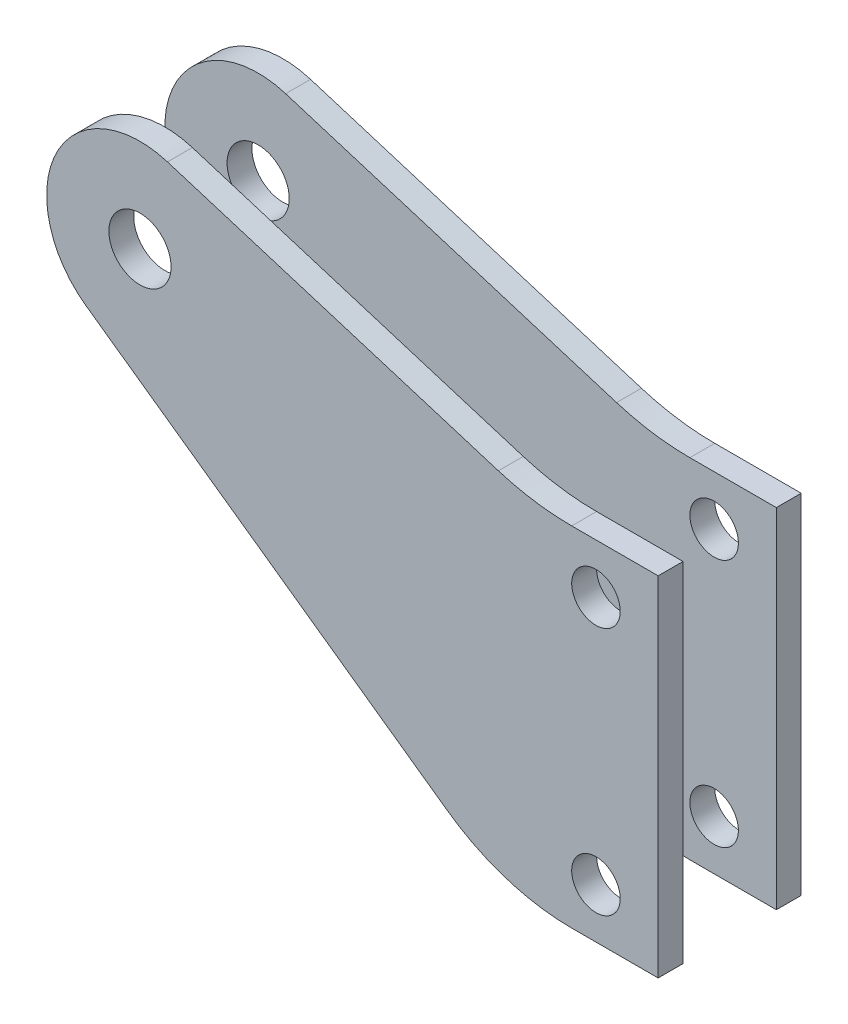
ISO-10303-21;
HEADER;
FILE_DESCRIPTION(('STEP AP214'),'2;1');
FILE_NAME('part.step','',(''),(''),'','','');
FILE_SCHEMA(('AUTOMOTIVE_DESIGN { 1 0 10303 214 1 1 1 1 }'));
ENDSEC;
DATA;
#1=APPLICATION_CONTEXT('core data for automotive mechanical design processes');
#2=APPLICATION_PROTOCOL_DEFINITION('international standard','automotive_design',2000,#1);
#3=PRODUCT_CONTEXT('',#1,'mechanical');
#4=PRODUCT('Part','Part','',(#3));
#5=PRODUCT_RELATED_PRODUCT_CATEGORY('part','',(#4));
#6=PRODUCT_DEFINITION_FORMATION('','',#4);
#7=PRODUCT_DEFINITION_CONTEXT('part definition',#1,'design');
#8=PRODUCT_DEFINITION('design','',#6,#7);
#9=PRODUCT_DEFINITION_SHAPE('','',#8);
#10=(LENGTH_UNIT() NAMED_UNIT(*) SI_UNIT(.MILLI.,.METRE.));
#11=(NAMED_UNIT(*) PLANE_ANGLE_UNIT() SI_UNIT($,.RADIAN.));
#12=(NAMED_UNIT(*) SI_UNIT($,.STERADIAN.) SOLID_ANGLE_UNIT());
#13=UNCERTAINTY_MEASURE_WITH_UNIT(LENGTH_MEASURE(1.E-05),#10,'distance_accuracy_value','');
#14=(GEOMETRIC_REPRESENTATION_CONTEXT(3) GLOBAL_UNCERTAINTY_ASSIGNED_CONTEXT((#13)) GLOBAL_UNIT_ASSIGNED_CONTEXT((#10,
#11,#12)) REPRESENTATION_CONTEXT('',''));
#15=CARTESIAN_POINT('',(0.,0.,0.));
#16=DIRECTION('',(0.,0.,1.));
#17=DIRECTION('',(1.,0.,0.));
#18=AXIS2_PLACEMENT_3D('',#15,#16,#17);
#19=CARTESIAN_POINT('',(0.,0.,-7.3025));
#20=DIRECTION('',(0.,0.,-1.));
#21=DIRECTION('',(1.,0.,0.));
#22=AXIS2_PLACEMENT_3D('',#19,#20,#21);
#23=PLANE('',#22);
#24=CARTESIAN_POINT('',(46.553879106,-32.924555614,-7.3025));
#25=DIRECTION('',(0.,0.,1.));
#26=DIRECTION('',(1.,0.,0.));
#27=AXIS2_PLACEMENT_3D('',#24,#25,#26);
#28=CIRCLE('',#27,2.4765);
#29=CARTESIAN_POINT('',(49.030379106,-32.924555614,-7.3025));
#30=VERTEX_POINT('',#29);
#31=EDGE_CURVE('E318',#30,#30,#28,.T.);
#32=ORIENTED_EDGE('',*,*,#31,.T.);
#33=EDGE_LOOP('',(#32));
#34=FACE_BOUND('',#33,.T.);
#35=CARTESIAN_POINT('',(0.,0.,-7.3025));
#36=DIRECTION('',(0.,0.,1.));
#37=DIRECTION('',(1.,0.,0.));
#38=AXIS2_PLACEMENT_3D('',#35,#36,#37);
#39=CIRCLE('',#38,9.525);
#40=CARTESIAN_POINT('',(2.80686492215751,9.10204011794947,-7.3025));
#41=VERTEX_POINT('',#40);
#42=CARTESIAN_POINT('',(-5.51360792058226,-7.76696547553113,-7.3025));
#43=VERTEX_POINT('',#42);
#44=EDGE_CURVE('E161',#41,#43,#39,.T.);
#45=ORIENTED_EDGE('',*,*,#44,.F.);
#46=DIRECTION('',(-0.955594763039315,0.294683981328873,0.));
#47=VECTOR('',#46,1.);
#48=CARTESIAN_POINT('',(2.80686492215751,9.10204011794947,-7.3025));
#49=LINE('',#48,#47);
#50=CARTESIAN_POINT('',(36.5924059802466,-1.31666259519861,-7.3025));
#51=VERTEX_POINT('',#50);
#52=EDGE_CURVE('E135',#51,#41,#49,.T.);
#53=ORIENTED_EDGE('',*,*,#52,.F.);
#54=CARTESIAN_POINT('',(44.077379106,22.955444386,-7.3025));
#55=DIRECTION('',(0.,0.,-1.));
#56=DIRECTION('',(-1.,0.,0.));
#57=AXIS2_PLACEMENT_3D('',#54,#55,#56);
#58=CIRCLE('',#57,25.4);
#59=CARTESIAN_POINT('',(44.077379106,-2.44455561400001,-7.3025));
#60=VERTEX_POINT('',#59);
#61=EDGE_CURVE('E116',#60,#51,#58,.T.);
#62=ORIENTED_EDGE('',*,*,#61,.F.);
#63=DIRECTION('',(-1.,0.,0.));
#64=VECTOR('',#63,1.);
#65=CARTESIAN_POINT('',(44.077379106,-2.444555614,-7.3025));
#66=LINE('',#65,#64);
#67=CARTESIAN_POINT('',(52.903879106,-2.444555614,-7.3025));
#68=VERTEX_POINT('',#67);
#69=EDGE_CURVE('E126',#68,#60,#66,.T.);
#70=ORIENTED_EDGE('',*,*,#69,.F.);
#71=DIRECTION('',(0.,1.,0.));
#72=VECTOR('',#71,1.);
#73=CARTESIAN_POINT('',(52.903879106,-2.444555614,-7.3025));
#74=LINE('',#73,#72);
#75=CARTESIAN_POINT('',(52.903879106,-38.004555614,-7.3025));
#76=VERTEX_POINT('',#75);
#77=EDGE_CURVE('E131',#76,#68,#74,.T.);
#78=ORIENTED_EDGE('',*,*,#77,.F.);
#79=DIRECTION('',(1.,0.,0.));
#80=VECTOR('',#79,1.);
#81=CARTESIAN_POINT('',(52.903879106,-38.004555614,-7.3025));
#82=LINE('',#81,#80);
#83=CARTESIAN_POINT('',(44.077379106,-38.004555614,-7.3025));
#84=VERTEX_POINT('',#83);
#85=EDGE_CURVE('E187',#84,#76,#82,.T.);
#86=ORIENTED_EDGE('',*,*,#85,.F.);
#87=CARTESIAN_POINT('',(44.077379106,-16.06474746253,-7.3025));
#88=DIRECTION('',(0.,0.,1.));
#89=DIRECTION('',(-1.,0.,0.));
#90=AXIS2_PLACEMENT_3D('',#87,#88,#89);
#91=CIRCLE('',#90,21.93980815147);
#92=CARTESIAN_POINT('',(31.377379106,-33.9551130743142,-7.3025));
#93=VERTEX_POINT('',#92);
#94=EDGE_CURVE('E180',#93,#84,#91,.T.);
#95=ORIENTED_EDGE('',*,*,#94,.F.);
#96=DIRECTION('',(0.815429446249988,-0.578856474601812,0.));
#97=VECTOR('',#96,1.);
#98=CARTESIAN_POINT('',(-5.51360792058226,-7.76696547553113,-7.3025));
#99=LINE('',#98,#97);
#100=EDGE_CURVE('E170',#43,#93,#99,.T.);
#101=ORIENTED_EDGE('',*,*,#100,.F.);
#102=EDGE_LOOP('',(#45,#53,#62,#70,#78,#86,#95,#101));
#103=FACE_BOUND('',#102,.T.);
#104=CARTESIAN_POINT('',(46.553879106,-7.524555614,-7.3025));
#105=DIRECTION('',(0.,0.,1.));
#106=DIRECTION('',(1.,0.,0.));
#107=AXIS2_PLACEMENT_3D('',#104,#105,#106);
#108=CIRCLE('',#107,2.47649999999999);
#109=CARTESIAN_POINT('',(49.030379106,-7.524555614,-7.3025));
#110=VERTEX_POINT('',#109);
#111=EDGE_CURVE('E144',#110,#110,#108,.T.);
#112=ORIENTED_EDGE('',*,*,#111,.T.);
#113=EDGE_LOOP('',(#112));
#114=FACE_BOUND('',#113,.T.);
#115=CARTESIAN_POINT('',(0.,0.,-7.3025));
#116=DIRECTION('',(0.,0.,1.));
#117=DIRECTION('',(1.,0.,0.));
#118=AXIS2_PLACEMENT_3D('',#115,#116,#117);
#119=CIRCLE('',#118,3.175);
#120=CARTESIAN_POINT('',(3.175,0.,-7.3025));
#121=VERTEX_POINT('',#120);
#122=EDGE_CURVE('E309',#121,#121,#119,.T.);
#123=ORIENTED_EDGE('',*,*,#122,.T.);
#124=EDGE_LOOP('',(#123));
#125=FACE_BOUND('',#124,.T.);
#126=ADVANCED_FACE('F43',(#34,#103,#114,#125),#23,.T.);
#127=CARTESIAN_POINT('',(0.,0.,-4.7625));
#128=DIRECTION('',(0.,0.,-1.));
#129=DIRECTION('',(1.,0.,0.));
#130=AXIS2_PLACEMENT_3D('',#127,#128,#129);
#131=PLANE('',#130);
#132=CARTESIAN_POINT('',(0.,0.,-4.7625));
#133=DIRECTION('',(0.,0.,1.));
#134=DIRECTION('',(1.,0.,0.));
#135=AXIS2_PLACEMENT_3D('',#132,#133,#134);
#136=CIRCLE('',#135,9.525);
#137=CARTESIAN_POINT('',(2.80686492215751,9.10204011794947,-4.7625));
#138=VERTEX_POINT('',#137);
#139=CARTESIAN_POINT('',(-5.51360792058226,-7.76696547553113,-4.7625));
#140=VERTEX_POINT('',#139);
#141=EDGE_CURVE('E140',#138,#140,#136,.T.);
#142=ORIENTED_EDGE('',*,*,#141,.T.);
#143=DIRECTION('',(0.815429446249988,-0.578856474601812,0.));
#144=VECTOR('',#143,1.);
#145=CARTESIAN_POINT('',(-5.51360792058226,-7.76696547553113,-4.7625));
#146=LINE('',#145,#144);
#147=CARTESIAN_POINT('',(31.377379106,-33.9551130743142,-4.7625));
#148=VERTEX_POINT('',#147);
#149=EDGE_CURVE('E143',#140,#148,#146,.T.);
#150=ORIENTED_EDGE('',*,*,#149,.T.);
#151=CARTESIAN_POINT('',(44.077379106,-16.06474746253,-4.7625));
#152=DIRECTION('',(0.,0.,1.));
#153=DIRECTION('',(-1.,0.,0.));
#154=AXIS2_PLACEMENT_3D('',#151,#152,#153);
#155=CIRCLE('',#154,21.93980815147);
#156=CARTESIAN_POINT('',(44.077379106,-38.004555614,-4.7625));
#157=VERTEX_POINT('',#156);
#158=EDGE_CURVE('E147',#148,#157,#155,.T.);
#159=ORIENTED_EDGE('',*,*,#158,.T.);
#160=DIRECTION('',(1.,0.,0.));
#161=VECTOR('',#160,1.);
#162=CARTESIAN_POINT('',(52.903879106,-38.004555614,-4.7625));
#163=LINE('',#162,#161);
#164=CARTESIAN_POINT('',(52.903879106,-38.004555614,-4.7625));
#165=VERTEX_POINT('',#164);
#166=EDGE_CURVE('E150',#157,#165,#163,.T.);
#167=ORIENTED_EDGE('',*,*,#166,.T.);
#168=DIRECTION('',(0.,1.,0.));
#169=VECTOR('',#168,1.);
#170=CARTESIAN_POINT('',(52.903879106,-2.444555614,-4.7625));
#171=LINE('',#170,#169);
#172=CARTESIAN_POINT('',(52.903879106,-2.444555614,-4.7625));
#173=VERTEX_POINT('',#172);
#174=EDGE_CURVE('E153',#165,#173,#171,.T.);
#175=ORIENTED_EDGE('',*,*,#174,.T.);
#176=DIRECTION('',(-1.,0.,0.));
#177=VECTOR('',#176,1.);
#178=CARTESIAN_POINT('',(44.077379106,-2.444555614,-4.7625));
#179=LINE('',#178,#177);
#180=CARTESIAN_POINT('',(44.077379106,-2.44455561400001,-4.7625));
#181=VERTEX_POINT('',#180);
#182=EDGE_CURVE('E156',#173,#181,#179,.T.);
#183=ORIENTED_EDGE('',*,*,#182,.T.);
#184=CARTESIAN_POINT('',(44.077379106,22.955444386,-4.7625));
#185=DIRECTION('',(0.,0.,-1.));
#186=DIRECTION('',(-1.,0.,0.));
#187=AXIS2_PLACEMENT_3D('',#184,#185,#186);
#188=CIRCLE('',#187,25.4);
#189=CARTESIAN_POINT('',(36.5924059802466,-1.31666259519861,-4.7625));
#190=VERTEX_POINT('',#189);
#191=EDGE_CURVE('E119',#181,#190,#188,.T.);
#192=ORIENTED_EDGE('',*,*,#191,.T.);
#193=DIRECTION('',(-0.955594763039315,0.294683981328873,0.));
#194=VECTOR('',#193,1.);
#195=CARTESIAN_POINT('',(2.80686492215751,9.10204011794947,-4.7625));
#196=LINE('',#195,#194);
#197=EDGE_CURVE('E159',#190,#138,#196,.T.);
#198=ORIENTED_EDGE('',*,*,#197,.T.);
#199=EDGE_LOOP('',(#142,#150,#159,#167,#175,#183,#192,#198));
#200=FACE_BOUND('',#199,.T.);
#201=CARTESIAN_POINT('',(46.553879106,-7.524555614,-4.7625));
#202=DIRECTION('',(0.,0.,1.));
#203=DIRECTION('',(1.,0.,0.));
#204=AXIS2_PLACEMENT_3D('',#201,#202,#203);
#205=CIRCLE('',#204,2.47649999999999);
#206=CARTESIAN_POINT('',(49.030379106,-7.524555614,-4.7625));
#207=VERTEX_POINT('',#206);
#208=EDGE_CURVE('E183',#207,#207,#205,.T.);
#209=ORIENTED_EDGE('',*,*,#208,.F.);
#210=EDGE_LOOP('',(#209));
#211=FACE_BOUND('',#210,.T.);
#212=CARTESIAN_POINT('',(46.553879106,-32.924555614,-4.7625));
#213=DIRECTION('',(0.,0.,1.));
#214=DIRECTION('',(1.,0.,0.));
#215=AXIS2_PLACEMENT_3D('',#212,#213,#214);
#216=CIRCLE('',#215,2.4765);
#217=CARTESIAN_POINT('',(49.030379106,-32.924555614,-4.7625));
#218=VERTEX_POINT('',#217);
#219=EDGE_CURVE('E315',#218,#218,#216,.T.);
#220=ORIENTED_EDGE('',*,*,#219,.F.);
#221=EDGE_LOOP('',(#220));
#222=FACE_BOUND('',#221,.T.);
#223=CARTESIAN_POINT('',(0.,0.,-4.7625));
#224=DIRECTION('',(0.,0.,1.));
#225=DIRECTION('',(1.,0.,0.));
#226=AXIS2_PLACEMENT_3D('',#223,#224,#225);
#227=CIRCLE('',#226,3.175);
#228=CARTESIAN_POINT('',(3.175,0.,-4.7625));
#229=VERTEX_POINT('',#228);
#230=EDGE_CURVE('E312',#229,#229,#227,.T.);
#231=ORIENTED_EDGE('',*,*,#230,.F.);
#232=EDGE_LOOP('',(#231));
#233=FACE_BOUND('',#232,.T.);
#234=ADVANCED_FACE('F177',(#200,#211,#222,#233),#131,.F.);
#235=CARTESIAN_POINT('',(0.,0.,-7.3025));
#236=DIRECTION('',(0.,0.,1.));
#237=DIRECTION('',(-1.,0.,0.));
#238=AXIS2_PLACEMENT_3D('',#235,#236,#237);
#239=CYLINDRICAL_SURFACE('',#238,9.525);
#240=ORIENTED_EDGE('',*,*,#141,.F.);
#241=DIRECTION('',(0.,0.,1.));
#242=VECTOR('',#241,1.);
#243=CARTESIAN_POINT('',(2.80686492215751,9.10204011794947,-7.3025));
#244=LINE('',#243,#242);
#245=EDGE_CURVE('E60',#41,#138,#244,.T.);
#246=ORIENTED_EDGE('',*,*,#245,.F.);
#247=ORIENTED_EDGE('',*,*,#44,.T.);
#248=DIRECTION('',(0.,0.,1.));
#249=VECTOR('',#248,1.);
#250=CARTESIAN_POINT('',(-5.51360792058226,-7.76696547553113,-7.3025));
#251=LINE('',#250,#249);
#252=EDGE_CURVE('E12',#43,#140,#251,.T.);
#253=ORIENTED_EDGE('',*,*,#252,.T.);
#254=EDGE_LOOP('',(#240,#246,#247,#253));
#255=FACE_BOUND('',#254,.T.);
#256=ADVANCED_FACE('F45',(#255),#239,.T.);
#257=CARTESIAN_POINT('',(-5.51360792058226,-7.76696547553113,-7.3025));
#258=DIRECTION('',(0.578856474601812,0.815429446249988,0.));
#259=DIRECTION('',(-0.815429446249988,0.578856474601812,0.));
#260=AXIS2_PLACEMENT_3D('',#257,#258,#259);
#261=PLANE('',#260);
#262=ORIENTED_EDGE('',*,*,#149,.F.);
#263=ORIENTED_EDGE('',*,*,#252,.F.);
#264=ORIENTED_EDGE('',*,*,#100,.T.);
#265=DIRECTION('',(0.,0.,1.));
#266=VECTOR('',#265,1.);
#267=CARTESIAN_POINT('',(31.377379106,-33.9551130743142,-7.3025));
#268=LINE('',#267,#266);
#269=EDGE_CURVE('E52',#93,#148,#268,.T.);
#270=ORIENTED_EDGE('',*,*,#269,.T.);
#271=EDGE_LOOP('',(#262,#263,#264,#270));
#272=FACE_BOUND('',#271,.T.);
#273=ADVANCED_FACE('F169',(#272),#261,.F.);
#274=CARTESIAN_POINT('',(44.077379106,-16.06474746253,-7.3025));
#275=DIRECTION('',(0.,0.,1.));
#276=DIRECTION('',(-1.,0.,0.));
#277=AXIS2_PLACEMENT_3D('',#274,#275,#276);
#278=CYLINDRICAL_SURFACE('',#277,21.93980815147);
#279=ORIENTED_EDGE('',*,*,#158,.F.);
#280=ORIENTED_EDGE('',*,*,#269,.F.);
#281=ORIENTED_EDGE('',*,*,#94,.T.);
#282=DIRECTION('',(0.,0.,1.));
#283=VECTOR('',#282,1.);
#284=CARTESIAN_POINT('',(44.077379106,-38.004555614,-7.3025));
#285=LINE('',#284,#283);
#286=EDGE_CURVE('E167',#84,#157,#285,.T.);
#287=ORIENTED_EDGE('',*,*,#286,.T.);
#288=EDGE_LOOP('',(#279,#280,#281,#287));
#289=FACE_BOUND('',#288,.T.);
#290=ADVANCED_FACE('F174',(#289),#278,.T.);
#291=CARTESIAN_POINT('',(52.903879106,-38.004555614,-7.3025));
#292=DIRECTION('',(0.,1.,0.));
#293=DIRECTION('',(0.,0.,-1.));
#294=AXIS2_PLACEMENT_3D('',#291,#292,#293);
#295=PLANE('',#294);
#296=ORIENTED_EDGE('',*,*,#166,.F.);
#297=ORIENTED_EDGE('',*,*,#286,.F.);
#298=ORIENTED_EDGE('',*,*,#85,.T.);
#299=DIRECTION('',(0.,0.,1.));
#300=VECTOR('',#299,1.);
#301=CARTESIAN_POINT('',(52.903879106,-38.004555614,-7.3025));
#302=LINE('',#301,#300);
#303=EDGE_CURVE('E165',#76,#165,#302,.T.);
#304=ORIENTED_EDGE('',*,*,#303,.T.);
#305=EDGE_LOOP('',(#296,#297,#298,#304));
#306=FACE_BOUND('',#305,.T.);
#307=ADVANCED_FACE('F194',(#306),#295,.F.);
#308=CARTESIAN_POINT('',(52.903879106,-2.444555614,-7.3025));
#309=DIRECTION('',(-1.,0.,0.));
#310=DIRECTION('',(0.,0.,-1.));
#311=AXIS2_PLACEMENT_3D('',#308,#309,#310);
#312=PLANE('',#311);
#313=ORIENTED_EDGE('',*,*,#174,.F.);
#314=ORIENTED_EDGE('',*,*,#303,.F.);
#315=ORIENTED_EDGE('',*,*,#77,.T.);
#316=DIRECTION('',(0.,0.,1.));
#317=VECTOR('',#316,1.);
#318=CARTESIAN_POINT('',(52.903879106,-2.444555614,-7.3025));
#319=LINE('',#318,#317);
#320=EDGE_CURVE('E123',#68,#173,#319,.T.);
#321=ORIENTED_EDGE('',*,*,#320,.T.);
#322=EDGE_LOOP('',(#313,#314,#315,#321));
#323=FACE_BOUND('',#322,.T.);
#324=ADVANCED_FACE('F191',(#323),#312,.F.);
#325=CARTESIAN_POINT('',(44.077379106,-2.444555614,-7.3025));
#326=DIRECTION('',(0.,-1.,0.));
#327=DIRECTION('',(1.,0.,0.));
#328=AXIS2_PLACEMENT_3D('',#325,#326,#327);
#329=PLANE('',#328);
#330=ORIENTED_EDGE('',*,*,#182,.F.);
#331=ORIENTED_EDGE('',*,*,#320,.F.);
#332=ORIENTED_EDGE('',*,*,#69,.T.);
#333=DIRECTION('',(0.,0.,1.));
#334=VECTOR('',#333,1.);
#335=CARTESIAN_POINT('',(44.077379106,-2.44455561400001,-7.3025));
#336=LINE('',#335,#334);
#337=EDGE_CURVE('E112',#60,#181,#336,.T.);
#338=ORIENTED_EDGE('',*,*,#337,.T.);
#339=EDGE_LOOP('',(#330,#331,#332,#338));
#340=FACE_BOUND('',#339,.T.);
#341=ADVANCED_FACE('F127',(#340),#329,.F.);
#342=CARTESIAN_POINT('',(44.077379106,22.955444386,-7.3025));
#343=DIRECTION('',(0.,0.,1.));
#344=DIRECTION('',(-1.,0.,0.));
#345=AXIS2_PLACEMENT_3D('',#342,#343,#344);
#346=CYLINDRICAL_SURFACE('',#345,25.4);
#347=ORIENTED_EDGE('',*,*,#191,.F.);
#348=ORIENTED_EDGE('',*,*,#337,.F.);
#349=ORIENTED_EDGE('',*,*,#61,.T.);
#350=DIRECTION('',(0.,0.,1.));
#351=VECTOR('',#350,1.);
#352=CARTESIAN_POINT('',(36.5924059802466,-1.31666259519861,-7.3025));
#353=LINE('',#352,#351);
#354=EDGE_CURVE('E88',#51,#190,#353,.T.);
#355=ORIENTED_EDGE('',*,*,#354,.T.);
#356=EDGE_LOOP('',(#347,#348,#349,#355));
#357=FACE_BOUND('',#356,.T.);
#358=ADVANCED_FACE('F114',(#357),#346,.F.);
#359=CARTESIAN_POINT('',(2.80686492215751,9.10204011794947,-7.3025));
#360=DIRECTION('',(-0.294683981328873,-0.955594763039315,0.));
#361=DIRECTION('',(0.955594763039315,-0.294683981328873,0.));
#362=AXIS2_PLACEMENT_3D('',#359,#360,#361);
#363=PLANE('',#362);
#364=ORIENTED_EDGE('',*,*,#197,.F.);
#365=ORIENTED_EDGE('',*,*,#354,.F.);
#366=ORIENTED_EDGE('',*,*,#52,.T.);
#367=ORIENTED_EDGE('',*,*,#245,.T.);
#368=EDGE_LOOP('',(#364,#365,#366,#367));
#369=FACE_BOUND('',#368,.T.);
#370=ADVANCED_FACE('F215',(#369),#363,.F.);
#371=CARTESIAN_POINT('',(46.553879106,-7.524555614,-7.3025));
#372=DIRECTION('',(0.,0.,1.));
#373=DIRECTION('',(-1.,0.,0.));
#374=AXIS2_PLACEMENT_3D('',#371,#372,#373);
#375=CYLINDRICAL_SURFACE('',#374,2.47649999999999);
#376=ORIENTED_EDGE('',*,*,#111,.F.);
#377=EDGE_LOOP('',(#376));
#378=FACE_BOUND('',#377,.T.);
#379=ORIENTED_EDGE('',*,*,#208,.T.);
#380=EDGE_LOOP('',(#379));
#381=FACE_BOUND('',#380,.T.);
#382=ADVANCED_FACE('F212',(#378,#381),#375,.F.);
#383=CARTESIAN_POINT('',(46.553879106,-32.924555614,-7.3025));
#384=DIRECTION('',(0.,0.,1.));
#385=DIRECTION('',(-1.,0.,0.));
#386=AXIS2_PLACEMENT_3D('',#383,#384,#385);
#387=CYLINDRICAL_SURFACE('',#386,2.4765);
#388=ORIENTED_EDGE('',*,*,#31,.F.);
#389=EDGE_LOOP('',(#388));
#390=FACE_BOUND('',#389,.T.);
#391=ORIENTED_EDGE('',*,*,#219,.T.);
#392=EDGE_LOOP('',(#391));
#393=FACE_BOUND('',#392,.T.);
#394=ADVANCED_FACE('F239',(#390,#393),#387,.F.);
#395=CARTESIAN_POINT('',(0.,0.,-7.3025));
#396=DIRECTION('',(0.,0.,1.));
#397=DIRECTION('',(-1.,0.,0.));
#398=AXIS2_PLACEMENT_3D('',#395,#396,#397);
#399=CYLINDRICAL_SURFACE('',#398,3.175);
#400=ORIENTED_EDGE('',*,*,#122,.F.);
#401=EDGE_LOOP('',(#400));
#402=FACE_BOUND('',#401,.T.);
#403=ORIENTED_EDGE('',*,*,#230,.T.);
#404=EDGE_LOOP('',(#403));
#405=FACE_BOUND('',#404,.T.);
#406=ADVANCED_FACE('F246',(#402,#405),#399,.F.);
#407=CLOSED_SHELL('',(#126,#234,#256,#273,#290,#307,#324,#341,#358,#370,#382,#394,#406));
#408=MANIFOLD_SOLID_BREP('B2',#407);
#409=CARTESIAN_POINT('',(0.,0.,7.3025));
#410=DIRECTION('',(0.,0.,1.));
#411=DIRECTION('',(1.,0.,0.));
#412=AXIS2_PLACEMENT_3D('',#409,#410,#411);
#413=PLANE('',#412);
#414=CARTESIAN_POINT('',(46.553879106,-32.924555614,7.3025));
#415=DIRECTION('',(0.,0.,1.));
#416=DIRECTION('',(1.,0.,0.));
#417=AXIS2_PLACEMENT_3D('',#414,#415,#416);
#418=CIRCLE('',#417,2.4765);
#419=CARTESIAN_POINT('',(49.030379106,-32.924555614,7.3025));
#420=VERTEX_POINT('',#419);
#421=EDGE_CURVE('E483',#420,#420,#418,.T.);
#422=ORIENTED_EDGE('',*,*,#421,.F.);
#423=EDGE_LOOP('',(#422));
#424=FACE_BOUND('',#423,.T.);
#425=CARTESIAN_POINT('',(0.,0.,7.3025));
#426=DIRECTION('',(0.,0.,1.));
#427=DIRECTION('',(1.,0.,0.));
#428=AXIS2_PLACEMENT_3D('',#425,#426,#427);
#429=CIRCLE('',#428,9.525);
#430=CARTESIAN_POINT('',(2.80686492215751,9.10204011794947,7.3025));
#431=VERTEX_POINT('',#430);
#432=CARTESIAN_POINT('',(-5.51360792058226,-7.76696547553113,7.3025));
#433=VERTEX_POINT('',#432);
#434=EDGE_CURVE('E446',#431,#433,#429,.T.);
#435=ORIENTED_EDGE('',*,*,#434,.T.);
#436=DIRECTION('',(0.815429446249988,-0.578856474601812,0.));
#437=VECTOR('',#436,1.);
#438=CARTESIAN_POINT('',(-5.51360792058226,-7.76696547553113,7.3025));
#439=LINE('',#438,#437);
#440=CARTESIAN_POINT('',(31.377379106,-33.9551130743142,7.3025));
#441=VERTEX_POINT('',#440);
#442=EDGE_CURVE('E394',#433,#441,#439,.T.);
#443=ORIENTED_EDGE('',*,*,#442,.T.);
#444=CARTESIAN_POINT('',(44.077379106,-16.06474746253,7.3025));
#445=DIRECTION('',(0.,0.,1.));
#446=DIRECTION('',(-1.,0.,0.));
#447=AXIS2_PLACEMENT_3D('',#444,#445,#446);
#448=CIRCLE('',#447,21.93980815147);
#449=CARTESIAN_POINT('',(44.077379106,-38.004555614,7.3025));
#450=VERTEX_POINT('',#449);
#451=EDGE_CURVE('E461',#441,#450,#448,.T.);
#452=ORIENTED_EDGE('',*,*,#451,.T.);
#453=DIRECTION('',(1.,0.,0.));
#454=VECTOR('',#453,1.);
#455=CARTESIAN_POINT('',(52.903879106,-38.004555614,7.3025));
#456=LINE('',#455,#454);
#457=CARTESIAN_POINT('',(52.903879106,-38.004555614,7.3025));
#458=VERTEX_POINT('',#457);
#459=EDGE_CURVE('E474',#450,#458,#456,.T.);
#460=ORIENTED_EDGE('',*,*,#459,.T.);
#461=DIRECTION('',(0.,1.,0.));
#462=VECTOR('',#461,1.);
#463=CARTESIAN_POINT('',(52.903879106,-2.444555614,7.3025));
#464=LINE('',#463,#462);
#465=CARTESIAN_POINT('',(52.903879106,-2.444555614,7.3025));
#466=VERTEX_POINT('',#465);
#467=EDGE_CURVE('E413',#458,#466,#464,.T.);
#468=ORIENTED_EDGE('',*,*,#467,.T.);
#469=DIRECTION('',(-1.,0.,0.));
#470=VECTOR('',#469,1.);
#471=CARTESIAN_POINT('',(44.077379106,-2.444555614,7.3025));
#472=LINE('',#471,#470);
#473=CARTESIAN_POINT('',(44.077379106,-2.44455561400001,7.3025));
#474=VERTEX_POINT('',#473);
#475=EDGE_CURVE('E407',#466,#474,#472,.T.);
#476=ORIENTED_EDGE('',*,*,#475,.T.);
#477=CARTESIAN_POINT('',(44.077379106,22.955444386,7.3025));
#478=DIRECTION('',(0.,0.,-1.));
#479=DIRECTION('',(-1.,0.,0.));
#480=AXIS2_PLACEMENT_3D('',#477,#478,#479);
#481=CIRCLE('',#480,25.4);
#482=CARTESIAN_POINT('',(36.5924059802466,-1.31666259519861,7.3025));
#483=VERTEX_POINT('',#482);
#484=EDGE_CURVE('E411',#474,#483,#481,.T.);
#485=ORIENTED_EDGE('',*,*,#484,.T.);
#486=DIRECTION('',(-0.955594763039315,0.294683981328873,0.));
#487=VECTOR('',#486,1.);
#488=CARTESIAN_POINT('',(2.80686492215751,9.10204011794947,7.3025));
#489=LINE('',#488,#487);
#490=EDGE_CURVE('E351',#483,#431,#489,.T.);
#491=ORIENTED_EDGE('',*,*,#490,.T.);
#492=EDGE_LOOP('',(#435,#443,#452,#460,#468,#476,#485,#491));
#493=FACE_BOUND('',#492,.T.);
#494=CARTESIAN_POINT('',(46.553879106,-7.524555614,7.3025));
#495=DIRECTION('',(0.,0.,1.));
#496=DIRECTION('',(1.,0.,0.));
#497=AXIS2_PLACEMENT_3D('',#494,#495,#496);
#498=CIRCLE('',#497,2.47649999999999);
#499=CARTESIAN_POINT('',(49.030379106,-7.524555614,7.3025));
#500=VERTEX_POINT('',#499);
#501=EDGE_CURVE('E435',#500,#500,#498,.T.);
#502=ORIENTED_EDGE('',*,*,#501,.F.);
#503=EDGE_LOOP('',(#502));
#504=FACE_BOUND('',#503,.T.);
#505=CARTESIAN_POINT('',(0.,0.,7.3025));
#506=DIRECTION('',(0.,0.,1.));
#507=DIRECTION('',(1.,0.,0.));
#508=AXIS2_PLACEMENT_3D('',#505,#506,#507);
#509=CIRCLE('',#508,3.175);
#510=CARTESIAN_POINT('',(3.175,0.,7.3025));
#511=VERTEX_POINT('',#510);
#512=EDGE_CURVE('E489',#511,#511,#509,.T.);
#513=ORIENTED_EDGE('',*,*,#512,.F.);
#514=EDGE_LOOP('',(#513));
#515=FACE_BOUND('',#514,.T.);
#516=ADVANCED_FACE('F334',(#424,#493,#504,#515),#413,.T.);
#517=CARTESIAN_POINT('',(0.,0.,4.7625));
#518=DIRECTION('',(0.,0.,1.));
#519=DIRECTION('',(1.,0.,0.));
#520=AXIS2_PLACEMENT_3D('',#517,#518,#519);
#521=PLANE('',#520);
#522=CARTESIAN_POINT('',(0.,0.,4.7625));
#523=DIRECTION('',(0.,0.,1.));
#524=DIRECTION('',(1.,0.,0.));
#525=AXIS2_PLACEMENT_3D('',#522,#523,#524);
#526=CIRCLE('',#525,9.525);
#527=CARTESIAN_POINT('',(2.80686492215751,9.10204011794947,4.7625));
#528=VERTEX_POINT('',#527);
#529=CARTESIAN_POINT('',(-5.51360792058226,-7.76696547553113,4.7625));
#530=VERTEX_POINT('',#529);
#531=EDGE_CURVE('E431',#528,#530,#526,.T.);
#532=ORIENTED_EDGE('',*,*,#531,.F.);
#533=DIRECTION('',(-0.955594763039315,0.294683981328873,0.));
#534=VECTOR('',#533,1.);
#535=CARTESIAN_POINT('',(2.80686492215751,9.10204011794947,4.7625));
#536=LINE('',#535,#534);
#537=CARTESIAN_POINT('',(36.5924059802466,-1.31666259519861,4.7625));
#538=VERTEX_POINT('',#537);
#539=EDGE_CURVE('E386',#538,#528,#536,.T.);
#540=ORIENTED_EDGE('',*,*,#539,.F.);
#541=CARTESIAN_POINT('',(44.077379106,22.955444386,4.7625));
#542=DIRECTION('',(0.,0.,-1.));
#543=DIRECTION('',(-1.,0.,0.));
#544=AXIS2_PLACEMENT_3D('',#541,#542,#543);
#545=CIRCLE('',#544,25.4);
#546=CARTESIAN_POINT('',(44.077379106,-2.44455561400001,4.7625));
#547=VERTEX_POINT('',#546);
#548=EDGE_CURVE('E380',#547,#538,#545,.T.);
#549=ORIENTED_EDGE('',*,*,#548,.F.);
#550=DIRECTION('',(-1.,0.,0.));
#551=VECTOR('',#550,1.);
#552=CARTESIAN_POINT('',(44.077379106,-2.444555614,4.7625));
#553=LINE('',#552,#551);
#554=CARTESIAN_POINT('',(52.903879106,-2.444555614,4.7625));
#555=VERTEX_POINT('',#554);
#556=EDGE_CURVE('E421',#555,#547,#553,.T.);
#557=ORIENTED_EDGE('',*,*,#556,.F.);
#558=DIRECTION('',(0.,1.,0.));
#559=VECTOR('',#558,1.);
#560=CARTESIAN_POINT('',(52.903879106,-2.444555614,4.7625));
#561=LINE('',#560,#559);
#562=CARTESIAN_POINT('',(52.903879106,-38.004555614,4.7625));
#563=VERTEX_POINT('',#562);
#564=EDGE_CURVE('E441',#563,#555,#561,.T.);
#565=ORIENTED_EDGE('',*,*,#564,.F.);
#566=DIRECTION('',(1.,0.,0.));
#567=VECTOR('',#566,1.);
#568=CARTESIAN_POINT('',(52.903879106,-38.004555614,4.7625));
#569=LINE('',#568,#567);
#570=CARTESIAN_POINT('',(44.077379106,-38.004555614,4.7625));
#571=VERTEX_POINT('',#570);
#572=EDGE_CURVE('E439',#571,#563,#569,.T.);
#573=ORIENTED_EDGE('',*,*,#572,.F.);
#574=CARTESIAN_POINT('',(44.077379106,-16.06474746253,4.7625));
#575=DIRECTION('',(0.,0.,1.));
#576=DIRECTION('',(-1.,0.,0.));
#577=AXIS2_PLACEMENT_3D('',#574,#575,#576);
#578=CIRCLE('',#577,21.93980815147);
#579=CARTESIAN_POINT('',(31.377379106,-33.9551130743142,4.7625));
#580=VERTEX_POINT('',#579);
#581=EDGE_CURVE('E437',#580,#571,#578,.T.);
#582=ORIENTED_EDGE('',*,*,#581,.F.);
#583=DIRECTION('',(0.815429446249988,-0.578856474601812,0.));
#584=VECTOR('',#583,1.);
#585=CARTESIAN_POINT('',(-5.51360792058226,-7.76696547553113,4.7625));
#586=LINE('',#585,#584);
#587=EDGE_CURVE('E434',#530,#580,#586,.T.);
#588=ORIENTED_EDGE('',*,*,#587,.F.);
#589=EDGE_LOOP('',(#532,#540,#549,#557,#565,#573,#582,#588));
#590=FACE_BOUND('',#589,.T.);
#591=CARTESIAN_POINT('',(46.553879106,-7.524555614,4.7625));
#592=DIRECTION('',(0.,0.,1.));
#593=DIRECTION('',(1.,0.,0.));
#594=AXIS2_PLACEMENT_3D('',#591,#592,#593);
#595=CIRCLE('',#594,2.47649999999999);
#596=CARTESIAN_POINT('',(49.030379106,-7.524555614,4.7625));
#597=VERTEX_POINT('',#596);
#598=EDGE_CURVE('E480',#597,#597,#595,.T.);
#599=ORIENTED_EDGE('',*,*,#598,.T.);
#600=EDGE_LOOP('',(#599));
#601=FACE_BOUND('',#600,.T.);
#602=CARTESIAN_POINT('',(46.553879106,-32.924555614,4.7625));
#603=DIRECTION('',(0.,0.,1.));
#604=DIRECTION('',(1.,0.,0.));
#605=AXIS2_PLACEMENT_3D('',#602,#603,#604);
#606=CIRCLE('',#605,2.4765);
#607=CARTESIAN_POINT('',(49.030379106,-32.924555614,4.7625));
#608=VERTEX_POINT('',#607);
#609=EDGE_CURVE('E486',#608,#608,#606,.T.);
#610=ORIENTED_EDGE('',*,*,#609,.T.);
#611=EDGE_LOOP('',(#610));
#612=FACE_BOUND('',#611,.T.);
#613=CARTESIAN_POINT('',(0.,0.,4.7625));
#614=DIRECTION('',(0.,0.,1.));
#615=DIRECTION('',(1.,0.,0.));
#616=AXIS2_PLACEMENT_3D('',#613,#614,#615);
#617=CIRCLE('',#616,3.175);
#618=CARTESIAN_POINT('',(3.175,0.,4.7625));
#619=VERTEX_POINT('',#618);
#620=EDGE_CURVE('E492',#619,#619,#617,.T.);
#621=ORIENTED_EDGE('',*,*,#620,.T.);
#622=EDGE_LOOP('',(#621));
#623=FACE_BOUND('',#622,.T.);
#624=ADVANCED_FACE('F465',(#590,#601,#612,#623),#521,.F.);
#625=CARTESIAN_POINT('',(0.,0.,7.3025));
#626=DIRECTION('',(0.,0.,-1.));
#627=DIRECTION('',(-1.,0.,0.));
#628=AXIS2_PLACEMENT_3D('',#625,#626,#627);
#629=CYLINDRICAL_SURFACE('',#628,9.525);
#630=ORIENTED_EDGE('',*,*,#531,.T.);
#631=DIRECTION('',(0.,0.,-1.));
#632=VECTOR('',#631,1.);
#633=CARTESIAN_POINT('',(-5.51360792058226,-7.76696547553113,7.3025));
#634=LINE('',#633,#632);
#635=EDGE_CURVE('E41',#433,#530,#634,.T.);
#636=ORIENTED_EDGE('',*,*,#635,.F.);
#637=ORIENTED_EDGE('',*,*,#434,.F.);
#638=DIRECTION('',(0.,0.,-1.));
#639=VECTOR('',#638,1.);
#640=CARTESIAN_POINT('',(2.80686492215751,9.10204011794947,7.3025));
#641=LINE('',#640,#639);
#642=EDGE_CURVE('E427',#431,#528,#641,.T.);
#643=ORIENTED_EDGE('',*,*,#642,.T.);
#644=EDGE_LOOP('',(#630,#636,#637,#643));
#645=FACE_BOUND('',#644,.T.);
#646=ADVANCED_FACE('F336',(#645),#629,.T.);
#647=CARTESIAN_POINT('',(-5.51360792058226,-7.76696547553113,7.3025));
#648=DIRECTION('',(0.578856474601812,0.815429446249988,0.));
#649=DIRECTION('',(-0.815429446249988,0.578856474601812,0.));
#650=AXIS2_PLACEMENT_3D('',#647,#648,#649);
#651=PLANE('',#650);
#652=ORIENTED_EDGE('',*,*,#587,.T.);
#653=DIRECTION('',(0.,0.,-1.));
#654=VECTOR('',#653,1.);
#655=CARTESIAN_POINT('',(31.377379106,-33.9551130743142,7.3025));
#656=LINE('',#655,#654);
#657=EDGE_CURVE('E343',#441,#580,#656,.T.);
#658=ORIENTED_EDGE('',*,*,#657,.F.);
#659=ORIENTED_EDGE('',*,*,#442,.F.);
#660=ORIENTED_EDGE('',*,*,#635,.T.);
#661=EDGE_LOOP('',(#652,#658,#659,#660));
#662=FACE_BOUND('',#661,.T.);
#663=ADVANCED_FACE('F525',(#662),#651,.F.);
#664=CARTESIAN_POINT('',(44.077379106,-16.06474746253,7.3025));
#665=DIRECTION('',(0.,0.,-1.));
#666=DIRECTION('',(-1.,0.,0.));
#667=AXIS2_PLACEMENT_3D('',#664,#665,#666);
#668=CYLINDRICAL_SURFACE('',#667,21.93980815147);
#669=ORIENTED_EDGE('',*,*,#581,.T.);
#670=DIRECTION('',(0.,0.,-1.));
#671=VECTOR('',#670,1.);
#672=CARTESIAN_POINT('',(44.077379106,-38.004555614,7.3025));
#673=LINE('',#672,#671);
#674=EDGE_CURVE('E453',#450,#571,#673,.T.);
#675=ORIENTED_EDGE('',*,*,#674,.F.);
#676=ORIENTED_EDGE('',*,*,#451,.F.);
#677=ORIENTED_EDGE('',*,*,#657,.T.);
#678=EDGE_LOOP('',(#669,#675,#676,#677));
#679=FACE_BOUND('',#678,.T.);
#680=ADVANCED_FACE('F459',(#679),#668,.T.);
#681=CARTESIAN_POINT('',(52.903879106,-38.004555614,7.3025));
#682=DIRECTION('',(0.,1.,0.));
#683=DIRECTION('',(0.,0.,1.));
#684=AXIS2_PLACEMENT_3D('',#681,#682,#683);
#685=PLANE('',#684);
#686=ORIENTED_EDGE('',*,*,#572,.T.);
#687=DIRECTION('',(0.,0.,-1.));
#688=VECTOR('',#687,1.);
#689=CARTESIAN_POINT('',(52.903879106,-38.004555614,7.3025));
#690=LINE('',#689,#688);
#691=EDGE_CURVE('E450',#458,#563,#690,.T.);
#692=ORIENTED_EDGE('',*,*,#691,.F.);
#693=ORIENTED_EDGE('',*,*,#459,.F.);
#694=ORIENTED_EDGE('',*,*,#674,.T.);
#695=EDGE_LOOP('',(#686,#692,#693,#694));
#696=FACE_BOUND('',#695,.T.);
#697=ADVANCED_FACE('F470',(#696),#685,.F.);
#698=CARTESIAN_POINT('',(52.903879106,-2.444555614,7.3025));
#699=DIRECTION('',(-1.,0.,0.));
#700=DIRECTION('',(0.,0.,1.));
#701=AXIS2_PLACEMENT_3D('',#698,#699,#700);
#702=PLANE('',#701);
#703=ORIENTED_EDGE('',*,*,#564,.T.);
#704=DIRECTION('',(0.,0.,-1.));
#705=VECTOR('',#704,1.);
#706=CARTESIAN_POINT('',(52.903879106,-2.444555614,7.3025));
#707=LINE('',#706,#705);
#708=EDGE_CURVE('E422',#466,#555,#707,.T.);
#709=ORIENTED_EDGE('',*,*,#708,.F.);
#710=ORIENTED_EDGE('',*,*,#467,.F.);
#711=ORIENTED_EDGE('',*,*,#691,.T.);
#712=EDGE_LOOP('',(#703,#709,#710,#711));
#713=FACE_BOUND('',#712,.T.);
#714=ADVANCED_FACE('F473',(#713),#702,.F.);
#715=CARTESIAN_POINT('',(44.077379106,-2.444555614,7.3025));
#716=DIRECTION('',(0.,-1.,0.));
#717=DIRECTION('',(1.,0.,0.));
#718=AXIS2_PLACEMENT_3D('',#715,#716,#717);
#719=PLANE('',#718);
#720=ORIENTED_EDGE('',*,*,#556,.T.);
#721=DIRECTION('',(0.,0.,-1.));
#722=VECTOR('',#721,1.);
#723=CARTESIAN_POINT('',(44.077379106,-2.44455561400001,7.3025));
#724=LINE('',#723,#722);
#725=EDGE_CURVE('E418',#474,#547,#724,.T.);
#726=ORIENTED_EDGE('',*,*,#725,.F.);
#727=ORIENTED_EDGE('',*,*,#475,.F.);
#728=ORIENTED_EDGE('',*,*,#708,.T.);
#729=EDGE_LOOP('',(#720,#726,#727,#728));
#730=FACE_BOUND('',#729,.T.);
#731=ADVANCED_FACE('F419',(#730),#719,.F.);
#732=CARTESIAN_POINT('',(44.077379106,22.955444386,7.3025));
#733=DIRECTION('',(0.,0.,-1.));
#734=DIRECTION('',(-1.,0.,0.));
#735=AXIS2_PLACEMENT_3D('',#732,#733,#734);
#736=CYLINDRICAL_SURFACE('',#735,25.4);
#737=ORIENTED_EDGE('',*,*,#548,.T.);
#738=DIRECTION('',(0.,0.,-1.));
#739=VECTOR('',#738,1.);
#740=CARTESIAN_POINT('',(36.5924059802466,-1.31666259519861,7.3025));
#741=LINE('',#740,#739);
#742=EDGE_CURVE('E423',#483,#538,#741,.T.);
#743=ORIENTED_EDGE('',*,*,#742,.F.);
#744=ORIENTED_EDGE('',*,*,#484,.F.);
#745=ORIENTED_EDGE('',*,*,#725,.T.);
#746=EDGE_LOOP('',(#737,#743,#744,#745));
#747=FACE_BOUND('',#746,.T.);
#748=ADVANCED_FACE('F425',(#747),#736,.F.);
#749=CARTESIAN_POINT('',(2.80686492215751,9.10204011794947,7.3025));
#750=DIRECTION('',(-0.294683981328873,-0.955594763039315,0.));
#751=DIRECTION('',(0.955594763039315,-0.294683981328873,0.));
#752=AXIS2_PLACEMENT_3D('',#749,#750,#751);
#753=PLANE('',#752);
#754=ORIENTED_EDGE('',*,*,#539,.T.);
#755=ORIENTED_EDGE('',*,*,#642,.F.);
#756=ORIENTED_EDGE('',*,*,#490,.F.);
#757=ORIENTED_EDGE('',*,*,#742,.T.);
#758=EDGE_LOOP('',(#754,#755,#756,#757));
#759=FACE_BOUND('',#758,.T.);
#760=ADVANCED_FACE('F513',(#759),#753,.F.);
#761=CARTESIAN_POINT('',(46.553879106,-7.524555614,7.3025));
#762=DIRECTION('',(0.,0.,-1.));
#763=DIRECTION('',(-1.,0.,0.));
#764=AXIS2_PLACEMENT_3D('',#761,#762,#763);
#765=CYLINDRICAL_SURFACE('',#764,2.47649999999999);
#766=ORIENTED_EDGE('',*,*,#501,.T.);
#767=EDGE_LOOP('',(#766));
#768=FACE_BOUND('',#767,.T.);
#769=ORIENTED_EDGE('',*,*,#598,.F.);
#770=EDGE_LOOP('',(#769));
#771=FACE_BOUND('',#770,.T.);
#772=ADVANCED_FACE('F510',(#768,#771),#765,.F.);
#773=CARTESIAN_POINT('',(46.553879106,-32.924555614,7.3025));
#774=DIRECTION('',(0.,0.,-1.));
#775=DIRECTION('',(-1.,0.,0.));
#776=AXIS2_PLACEMENT_3D('',#773,#774,#775);
#777=CYLINDRICAL_SURFACE('',#776,2.4765);
#778=ORIENTED_EDGE('',*,*,#421,.T.);
#779=EDGE_LOOP('',(#778));
#780=FACE_BOUND('',#779,.T.);
#781=ORIENTED_EDGE('',*,*,#609,.F.);
#782=EDGE_LOOP('',(#781));
#783=FACE_BOUND('',#782,.T.);
#784=ADVANCED_FACE('F589',(#780,#783),#777,.F.);
#785=CARTESIAN_POINT('',(0.,0.,7.3025));
#786=DIRECTION('',(0.,0.,-1.));
#787=DIRECTION('',(-1.,0.,0.));
#788=AXIS2_PLACEMENT_3D('',#785,#786,#787);
#789=CYLINDRICAL_SURFACE('',#788,3.175);
#790=ORIENTED_EDGE('',*,*,#512,.T.);
#791=EDGE_LOOP('',(#790));
#792=FACE_BOUND('',#791,.T.);
#793=ORIENTED_EDGE('',*,*,#620,.F.);
#794=EDGE_LOOP('',(#793));
#795=FACE_BOUND('',#794,.T.);
#796=ADVANCED_FACE('F498',(#792,#795),#789,.F.);
#797=CLOSED_SHELL('',(#516,#624,#646,#663,#680,#697,#714,#731,#748,#760,#772,#784,#796));
#798=MANIFOLD_SOLID_BREP('B6',#797);
#799=ADVANCED_BREP_SHAPE_REPRESENTATION('',(#18,#408,#798),#14);
#800=SHAPE_DEFINITION_REPRESENTATION(#9,#799);
ENDSEC;
END-ISO-10303-21;
